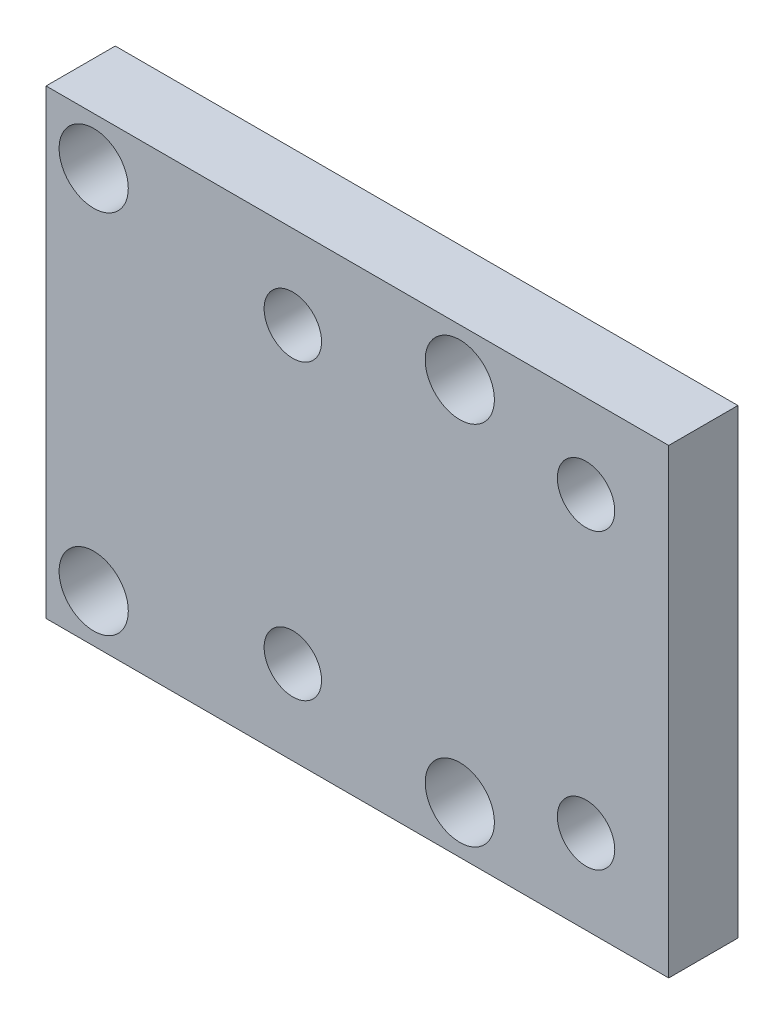
ISO-10303-21;
HEADER;
FILE_DESCRIPTION(('STEP AP214'),'2;1');
FILE_NAME('part.step','',(''),(''),'','','');
FILE_SCHEMA(('AUTOMOTIVE_DESIGN { 1 0 10303 214 1 1 1 1 }'));
ENDSEC;
DATA;
#1=APPLICATION_CONTEXT('core data for automotive mechanical design processes');
#2=APPLICATION_PROTOCOL_DEFINITION('international standard','automotive_design',2000,#1);
#3=PRODUCT_CONTEXT('',#1,'mechanical');
#4=PRODUCT('Part','Part','',(#3));
#5=PRODUCT_RELATED_PRODUCT_CATEGORY('part','',(#4));
#6=PRODUCT_DEFINITION_FORMATION('','',#4);
#7=PRODUCT_DEFINITION_CONTEXT('part definition',#1,'design');
#8=PRODUCT_DEFINITION('design','',#6,#7);
#9=PRODUCT_DEFINITION_SHAPE('','',#8);
#10=(LENGTH_UNIT() NAMED_UNIT(*) SI_UNIT(.MILLI.,.METRE.));
#11=(NAMED_UNIT(*) PLANE_ANGLE_UNIT() SI_UNIT($,.RADIAN.));
#12=(NAMED_UNIT(*) SI_UNIT($,.STERADIAN.) SOLID_ANGLE_UNIT());
#13=UNCERTAINTY_MEASURE_WITH_UNIT(LENGTH_MEASURE(1.E-05),#10,'distance_accuracy_value','');
#14=(GEOMETRIC_REPRESENTATION_CONTEXT(3) GLOBAL_UNCERTAINTY_ASSIGNED_CONTEXT((#13)) GLOBAL_UNIT_ASSIGNED_CONTEXT((#10,
#11,#12)) REPRESENTATION_CONTEXT('',''));
#15=CARTESIAN_POINT('',(0.,0.,0.));
#16=DIRECTION('',(0.,0.,1.));
#17=DIRECTION('',(1.,0.,0.));
#18=AXIS2_PLACEMENT_3D('',#15,#16,#17);
#19=CARTESIAN_POINT('',(-61.3,-35.875,6.));
#20=DIRECTION('',(0.,0.,-1.));
#21=DIRECTION('',(-1.,0.,0.));
#22=AXIS2_PLACEMENT_3D('',#19,#20,#21);
#23=CYLINDRICAL_SURFACE('',#22,2.);
#24=CARTESIAN_POINT('',(-61.3,-35.875,0.));
#25=DIRECTION('',(0.,0.,1.));
#26=DIRECTION('',(1.,0.,0.));
#27=AXIS2_PLACEMENT_3D('',#24,#25,#26);
#28=CIRCLE('',#27,2.);
#29=CARTESIAN_POINT('',(-59.3,-35.875,0.));
#30=VERTEX_POINT('',#29);
#31=EDGE_CURVE('E105',#30,#30,#28,.T.);
#32=ORIENTED_EDGE('',*,*,#31,.F.);
#33=EDGE_LOOP('',(#32));
#34=FACE_BOUND('',#33,.T.);
#35=CARTESIAN_POINT('',(-61.3,-35.875,1.));
#36=DIRECTION('',(0.,0.,1.));
#37=DIRECTION('',(1.,0.,0.));
#38=AXIS2_PLACEMENT_3D('',#35,#36,#37);
#39=CIRCLE('',#38,2.);
#40=CARTESIAN_POINT('',(-59.3,-35.875,1.));
#41=VERTEX_POINT('',#40);
#42=EDGE_CURVE('E39',#41,#41,#39,.T.);
#43=ORIENTED_EDGE('',*,*,#42,.T.);
#44=EDGE_LOOP('',(#43));
#45=FACE_BOUND('',#44,.T.);
#46=ADVANCED_FACE('F35',(#34,#45),#23,.F.);
#47=CARTESIAN_POINT('',(-29.55,-35.875,6.));
#48=DIRECTION('',(0.,0.,-1.));
#49=DIRECTION('',(-1.,0.,0.));
#50=AXIS2_PLACEMENT_3D('',#47,#48,#49);
#51=CYLINDRICAL_SURFACE('',#50,2.);
#52=CARTESIAN_POINT('',(-29.55,-35.875,0.));
#53=DIRECTION('',(0.,0.,1.));
#54=DIRECTION('',(1.,0.,0.));
#55=AXIS2_PLACEMENT_3D('',#52,#53,#54);
#56=CIRCLE('',#55,2.);
#57=CARTESIAN_POINT('',(-27.55,-35.875,0.));
#58=VERTEX_POINT('',#57);
#59=EDGE_CURVE('E150',#58,#58,#56,.T.);
#60=ORIENTED_EDGE('',*,*,#59,.F.);
#61=EDGE_LOOP('',(#60));
#62=FACE_BOUND('',#61,.T.);
#63=CARTESIAN_POINT('',(-29.55,-35.875,1.));
#64=DIRECTION('',(0.,0.,1.));
#65=DIRECTION('',(1.,0.,0.));
#66=AXIS2_PLACEMENT_3D('',#63,#64,#65);
#67=CIRCLE('',#66,2.);
#68=CARTESIAN_POINT('',(-27.55,-35.875,1.));
#69=VERTEX_POINT('',#68);
#70=EDGE_CURVE('E120',#69,#69,#67,.T.);
#71=ORIENTED_EDGE('',*,*,#70,.T.);
#72=EDGE_LOOP('',(#71));
#73=FACE_BOUND('',#72,.T.);
#74=ADVANCED_FACE('F161',(#62,#73),#51,.F.);
#75=CARTESIAN_POINT('',(-29.5500000000001,-4.12500000000002,6.));
#76=DIRECTION('',(0.,0.,-1.));
#77=DIRECTION('',(-1.,0.,0.));
#78=AXIS2_PLACEMENT_3D('',#75,#76,#77);
#79=CYLINDRICAL_SURFACE('',#78,2.);
#80=CARTESIAN_POINT('',(-29.5500000000001,-4.12500000000002,0.));
#81=DIRECTION('',(0.,0.,1.));
#82=DIRECTION('',(1.,0.,0.));
#83=AXIS2_PLACEMENT_3D('',#80,#81,#82);
#84=CIRCLE('',#83,2.);
#85=CARTESIAN_POINT('',(-27.5500000000001,-4.12500000000002,0.));
#86=VERTEX_POINT('',#85);
#87=EDGE_CURVE('E147',#86,#86,#84,.T.);
#88=ORIENTED_EDGE('',*,*,#87,.F.);
#89=EDGE_LOOP('',(#88));
#90=FACE_BOUND('',#89,.T.);
#91=CARTESIAN_POINT('',(-29.5500000000001,-4.12500000000002,1.));
#92=DIRECTION('',(0.,0.,1.));
#93=DIRECTION('',(1.,0.,0.));
#94=AXIS2_PLACEMENT_3D('',#91,#92,#93);
#95=CIRCLE('',#94,2.);
#96=CARTESIAN_POINT('',(-27.5500000000001,-4.12500000000002,1.));
#97=VERTEX_POINT('',#96);
#98=EDGE_CURVE('E116',#97,#97,#95,.T.);
#99=ORIENTED_EDGE('',*,*,#98,.T.);
#100=EDGE_LOOP('',(#99));
#101=FACE_BOUND('',#100,.T.);
#102=ADVANCED_FACE('F237',(#90,#101),#79,.F.);
#103=CARTESIAN_POINT('',(-61.3000000000001,-4.12500000000002,6.));
#104=DIRECTION('',(0.,0.,-1.));
#105=DIRECTION('',(-1.,0.,0.));
#106=AXIS2_PLACEMENT_3D('',#103,#104,#105);
#107=CYLINDRICAL_SURFACE('',#106,2.);
#108=CARTESIAN_POINT('',(-61.3000000000001,-4.12500000000002,0.));
#109=DIRECTION('',(0.,0.,1.));
#110=DIRECTION('',(1.,0.,0.));
#111=AXIS2_PLACEMENT_3D('',#108,#109,#110);
#112=CIRCLE('',#111,2.);
#113=CARTESIAN_POINT('',(-59.3000000000001,-4.12500000000002,0.));
#114=VERTEX_POINT('',#113);
#115=EDGE_CURVE('E114',#114,#114,#112,.T.);
#116=ORIENTED_EDGE('',*,*,#115,.F.);
#117=EDGE_LOOP('',(#116));
#118=FACE_BOUND('',#117,.T.);
#119=CARTESIAN_POINT('',(-61.3000000000001,-4.12500000000002,1.));
#120=DIRECTION('',(0.,0.,1.));
#121=DIRECTION('',(1.,0.,0.));
#122=AXIS2_PLACEMENT_3D('',#119,#120,#121);
#123=CIRCLE('',#122,2.);
#124=CARTESIAN_POINT('',(-59.3000000000001,-4.12500000000002,1.));
#125=VERTEX_POINT('',#124);
#126=EDGE_CURVE('E111',#125,#125,#123,.T.);
#127=ORIENTED_EDGE('',*,*,#126,.T.);
#128=EDGE_LOOP('',(#127));
#129=FACE_BOUND('',#128,.T.);
#130=ADVANCED_FACE('F202',(#118,#129),#107,.F.);
#131=CARTESIAN_POINT('',(0.,0.,6.));
#132=DIRECTION('',(0.,0.,-1.));
#133=DIRECTION('',(-1.,0.,0.));
#134=AXIS2_PLACEMENT_3D('',#131,#132,#133);
#135=PLANE('',#134);
#136=CARTESIAN_POINT('',(-18.6008068844062,-32.6999999999024,6.));
#137=DIRECTION('',(0.,0.,1.));
#138=DIRECTION('',(1.,0.,0.));
#139=AXIS2_PLACEMENT_3D('',#136,#137,#138);
#140=CIRCLE('',#139,2.49);
#141=CARTESIAN_POINT('',(-16.1108068844062,-32.6999999999024,6.));
#142=VERTEX_POINT('',#141);
#143=EDGE_CURVE('E193',#142,#142,#140,.T.);
#144=ORIENTED_EDGE('',*,*,#143,.F.);
#145=EDGE_LOOP('',(#144));
#146=FACE_BOUND('',#145,.T.);
#147=CARTESIAN_POINT('',(-44.0308068844062,-32.6999999999025,6.));
#148=DIRECTION('',(0.,0.,1.));
#149=DIRECTION('',(1.,0.,0.));
#150=AXIS2_PLACEMENT_3D('',#147,#148,#149);
#151=CIRCLE('',#150,2.49);
#152=CARTESIAN_POINT('',(-41.5408068844062,-32.6999999999025,6.));
#153=VERTEX_POINT('',#152);
#154=EDGE_CURVE('E187',#153,#153,#151,.T.);
#155=ORIENTED_EDGE('',*,*,#154,.F.);
#156=EDGE_LOOP('',(#155));
#157=FACE_BOUND('',#156,.T.);
#158=CARTESIAN_POINT('',(-44.0308068844065,-7.26999999990253,6.));
#159=DIRECTION('',(0.,0.,1.));
#160=DIRECTION('',(1.,0.,0.));
#161=AXIS2_PLACEMENT_3D('',#158,#159,#160);
#162=CIRCLE('',#161,2.49);
#163=CARTESIAN_POINT('',(-41.5408068844065,-7.26999999990253,6.));
#164=VERTEX_POINT('',#163);
#165=EDGE_CURVE('E181',#164,#164,#162,.T.);
#166=ORIENTED_EDGE('',*,*,#165,.F.);
#167=EDGE_LOOP('',(#166));
#168=FACE_BOUND('',#167,.T.);
#169=CARTESIAN_POINT('',(-18.6008068844065,-7.26999999990236,6.));
#170=DIRECTION('',(0.,0.,1.));
#171=DIRECTION('',(1.,0.,0.));
#172=AXIS2_PLACEMENT_3D('',#169,#170,#171);
#173=CIRCLE('',#172,2.49);
#174=CARTESIAN_POINT('',(-16.1108068844065,-7.26999999990236,6.));
#175=VERTEX_POINT('',#174);
#176=EDGE_CURVE('E175',#175,#175,#173,.T.);
#177=ORIENTED_EDGE('',*,*,#176,.F.);
#178=EDGE_LOOP('',(#177));
#179=FACE_BOUND('',#178,.T.);
#180=CARTESIAN_POINT('',(-61.2999999999998,-35.875,6.));
#181=DIRECTION('',(0.,0.,1.));
#182=DIRECTION('',(1.,0.,0.));
#183=AXIS2_PLACEMENT_3D('',#180,#181,#182);
#184=CIRCLE('',#183,3.);
#185=CARTESIAN_POINT('',(-58.2999999999998,-35.875,6.));
#186=VERTEX_POINT('',#185);
#187=EDGE_CURVE('E136',#186,#186,#184,.T.);
#188=ORIENTED_EDGE('',*,*,#187,.F.);
#189=EDGE_LOOP('',(#188));
#190=FACE_BOUND('',#189,.T.);
#191=CARTESIAN_POINT('',(-29.5499999999998,-35.875,6.));
#192=DIRECTION('',(0.,0.,1.));
#193=DIRECTION('',(1.,0.,0.));
#194=AXIS2_PLACEMENT_3D('',#191,#192,#193);
#195=CIRCLE('',#194,3.);
#196=CARTESIAN_POINT('',(-26.5499999999998,-35.875,6.));
#197=VERTEX_POINT('',#196);
#198=EDGE_CURVE('E129',#197,#197,#195,.T.);
#199=ORIENTED_EDGE('',*,*,#198,.F.);
#200=EDGE_LOOP('',(#199));
#201=FACE_BOUND('',#200,.T.);
#202=CARTESIAN_POINT('',(-29.5500000000001,-4.12500000000002,6.));
#203=DIRECTION('',(0.,0.,1.));
#204=DIRECTION('',(1.,0.,0.));
#205=AXIS2_PLACEMENT_3D('',#202,#203,#204);
#206=CIRCLE('',#205,3.);
#207=CARTESIAN_POINT('',(-26.5500000000001,-4.12500000000002,6.));
#208=VERTEX_POINT('',#207);
#209=EDGE_CURVE('E122',#208,#208,#206,.T.);
#210=ORIENTED_EDGE('',*,*,#209,.F.);
#211=EDGE_LOOP('',(#210));
#212=FACE_BOUND('',#211,.T.);
#213=CARTESIAN_POINT('',(-61.3000000000001,-4.12500000000002,6.));
#214=DIRECTION('',(0.,0.,1.));
#215=DIRECTION('',(1.,0.,0.));
#216=AXIS2_PLACEMENT_3D('',#213,#214,#215);
#217=CIRCLE('',#216,3.);
#218=CARTESIAN_POINT('',(-58.3000000000001,-4.12500000000002,6.));
#219=VERTEX_POINT('',#218);
#220=EDGE_CURVE('E118',#219,#219,#217,.T.);
#221=ORIENTED_EDGE('',*,*,#220,.F.);
#222=EDGE_LOOP('',(#221));
#223=FACE_BOUND('',#222,.T.);
#224=DIRECTION('',(0.,1.,0.));
#225=VECTOR('',#224,1.);
#226=CARTESIAN_POINT('',(-11.43,0.,6.));
#227=LINE('',#226,#225);
#228=CARTESIAN_POINT('',(-11.43,-40.,6.));
#229=VERTEX_POINT('',#228);
#230=CARTESIAN_POINT('',(-11.43,0.,6.));
#231=VERTEX_POINT('',#230);
#232=EDGE_CURVE('E89',#229,#231,#227,.T.);
#233=ORIENTED_EDGE('',*,*,#232,.T.);
#234=DIRECTION('',(-1.,0.,0.));
#235=VECTOR('',#234,1.);
#236=CARTESIAN_POINT('',(-11.43,0.,6.));
#237=LINE('',#236,#235);
#238=CARTESIAN_POINT('',(-65.43,0.,6.));
#239=VERTEX_POINT('',#238);
#240=EDGE_CURVE('E84',#231,#239,#237,.T.);
#241=ORIENTED_EDGE('',*,*,#240,.T.);
#242=DIRECTION('',(0.,-1.,0.));
#243=VECTOR('',#242,1.);
#244=CARTESIAN_POINT('',(-65.43,0.,6.));
#245=LINE('',#244,#243);
#246=CARTESIAN_POINT('',(-65.43,-40.,6.));
#247=VERTEX_POINT('',#246);
#248=EDGE_CURVE('E87',#239,#247,#245,.T.);
#249=ORIENTED_EDGE('',*,*,#248,.T.);
#250=DIRECTION('',(1.,0.,0.));
#251=VECTOR('',#250,1.);
#252=CARTESIAN_POINT('',(-11.43,-40.,6.));
#253=LINE('',#252,#251);
#254=EDGE_CURVE('E54',#247,#229,#253,.T.);
#255=ORIENTED_EDGE('',*,*,#254,.T.);
#256=EDGE_LOOP('',(#233,#241,#249,#255));
#257=FACE_BOUND('',#256,.T.);
#258=ADVANCED_FACE('F85',(#146,#157,#168,#179,#190,#201,#212,#223,#257),#135,.F.);
#259=CARTESIAN_POINT('',(0.,0.,0.));
#260=DIRECTION('',(0.,0.,-1.));
#261=DIRECTION('',(-1.,0.,0.));
#262=AXIS2_PLACEMENT_3D('',#259,#260,#261);
#263=PLANE('',#262);
#264=CARTESIAN_POINT('',(-18.6008068844062,-32.6999999999024,0.));
#265=DIRECTION('',(0.,0.,-1.));
#266=DIRECTION('',(-1.,0.,0.));
#267=AXIS2_PLACEMENT_3D('',#264,#265,#266);
#268=CIRCLE('',#267,2.49);
#269=CARTESIAN_POINT('',(-21.0908068844062,-32.6999999999024,0.));
#270=VERTEX_POINT('',#269);
#271=EDGE_CURVE('E190',#270,#270,#268,.F.);
#272=ORIENTED_EDGE('',*,*,#271,.T.);
#273=EDGE_LOOP('',(#272));
#274=FACE_BOUND('',#273,.T.);
#275=CARTESIAN_POINT('',(-44.0308068844062,-32.6999999999025,0.));
#276=DIRECTION('',(0.,0.,-1.));
#277=DIRECTION('',(-1.,0.,0.));
#278=AXIS2_PLACEMENT_3D('',#275,#276,#277);
#279=CIRCLE('',#278,2.49);
#280=CARTESIAN_POINT('',(-46.5208068844062,-32.6999999999025,0.));
#281=VERTEX_POINT('',#280);
#282=EDGE_CURVE('E184',#281,#281,#279,.F.);
#283=ORIENTED_EDGE('',*,*,#282,.T.);
#284=EDGE_LOOP('',(#283));
#285=FACE_BOUND('',#284,.T.);
#286=CARTESIAN_POINT('',(-44.0308068844065,-7.26999999990253,0.));
#287=DIRECTION('',(0.,0.,-1.));
#288=DIRECTION('',(-1.,0.,0.));
#289=AXIS2_PLACEMENT_3D('',#286,#287,#288);
#290=CIRCLE('',#289,2.49);
#291=CARTESIAN_POINT('',(-46.5208068844065,-7.26999999990253,0.));
#292=VERTEX_POINT('',#291);
#293=EDGE_CURVE('E178',#292,#292,#290,.F.);
#294=ORIENTED_EDGE('',*,*,#293,.T.);
#295=EDGE_LOOP('',(#294));
#296=FACE_BOUND('',#295,.T.);
#297=CARTESIAN_POINT('',(-18.6008068844065,-7.26999999990236,0.));
#298=DIRECTION('',(0.,0.,-1.));
#299=DIRECTION('',(-1.,0.,0.));
#300=AXIS2_PLACEMENT_3D('',#297,#298,#299);
#301=CIRCLE('',#300,2.49);
#302=CARTESIAN_POINT('',(-21.0908068844065,-7.26999999990236,0.));
#303=VERTEX_POINT('',#302);
#304=EDGE_CURVE('E171',#303,#303,#301,.F.);
#305=ORIENTED_EDGE('',*,*,#304,.T.);
#306=EDGE_LOOP('',(#305));
#307=FACE_BOUND('',#306,.T.);
#308=ORIENTED_EDGE('',*,*,#87,.T.);
#309=EDGE_LOOP('',(#308));
#310=FACE_BOUND('',#309,.T.);
#311=ORIENTED_EDGE('',*,*,#31,.T.);
#312=EDGE_LOOP('',(#311));
#313=FACE_BOUND('',#312,.T.);
#314=DIRECTION('',(0.,1.,0.));
#315=VECTOR('',#314,1.);
#316=CARTESIAN_POINT('',(-11.43,0.,0.));
#317=LINE('',#316,#315);
#318=CARTESIAN_POINT('',(-11.43,-40.,0.));
#319=VERTEX_POINT('',#318);
#320=CARTESIAN_POINT('',(-11.43,0.,0.));
#321=VERTEX_POINT('',#320);
#322=EDGE_CURVE('E102',#319,#321,#317,.T.);
#323=ORIENTED_EDGE('',*,*,#322,.F.);
#324=DIRECTION('',(1.,0.,0.));
#325=VECTOR('',#324,1.);
#326=CARTESIAN_POINT('',(-11.43,-40.,0.));
#327=LINE('',#326,#325);
#328=CARTESIAN_POINT('',(-65.43,-40.,0.));
#329=VERTEX_POINT('',#328);
#330=EDGE_CURVE('E77',#329,#319,#327,.T.);
#331=ORIENTED_EDGE('',*,*,#330,.F.);
#332=DIRECTION('',(0.,-1.,0.));
#333=VECTOR('',#332,1.);
#334=CARTESIAN_POINT('',(-65.43,0.,0.));
#335=LINE('',#334,#333);
#336=CARTESIAN_POINT('',(-65.43,0.,0.));
#337=VERTEX_POINT('',#336);
#338=EDGE_CURVE('E71',#337,#329,#335,.T.);
#339=ORIENTED_EDGE('',*,*,#338,.F.);
#340=DIRECTION('',(-1.,0.,0.));
#341=VECTOR('',#340,1.);
#342=CARTESIAN_POINT('',(-11.43,0.,0.));
#343=LINE('',#342,#341);
#344=EDGE_CURVE('E93',#321,#337,#343,.T.);
#345=ORIENTED_EDGE('',*,*,#344,.F.);
#346=EDGE_LOOP('',(#323,#331,#339,#345));
#347=FACE_BOUND('',#346,.T.);
#348=ORIENTED_EDGE('',*,*,#59,.T.);
#349=EDGE_LOOP('',(#348));
#350=FACE_BOUND('',#349,.T.);
#351=ORIENTED_EDGE('',*,*,#115,.T.);
#352=EDGE_LOOP('',(#351));
#353=FACE_BOUND('',#352,.T.);
#354=ADVANCED_FACE('F156',(#274,#285,#296,#307,#310,#313,#347,#350,#353),#263,.T.);
#355=CARTESIAN_POINT('',(-11.43,0.,6.));
#356=DIRECTION('',(-1.,0.,0.));
#357=DIRECTION('',(0.,-1.,0.));
#358=AXIS2_PLACEMENT_3D('',#355,#356,#357);
#359=PLANE('',#358);
#360=ORIENTED_EDGE('',*,*,#322,.T.);
#361=DIRECTION('',(0.,0.,-1.));
#362=VECTOR('',#361,1.);
#363=CARTESIAN_POINT('',(-11.43,0.,6.));
#364=LINE('',#363,#362);
#365=EDGE_CURVE('E11',#231,#321,#364,.T.);
#366=ORIENTED_EDGE('',*,*,#365,.F.);
#367=ORIENTED_EDGE('',*,*,#232,.F.);
#368=DIRECTION('',(0.,0.,-1.));
#369=VECTOR('',#368,1.);
#370=CARTESIAN_POINT('',(-11.43,-40.,6.));
#371=LINE('',#370,#369);
#372=EDGE_CURVE('E98',#229,#319,#371,.T.);
#373=ORIENTED_EDGE('',*,*,#372,.T.);
#374=EDGE_LOOP('',(#360,#366,#367,#373));
#375=FACE_BOUND('',#374,.T.);
#376=ADVANCED_FACE('F37',(#375),#359,.F.);
#377=CARTESIAN_POINT('',(-11.43,0.,6.));
#378=DIRECTION('',(0.,-1.,0.));
#379=DIRECTION('',(1.,0.,0.));
#380=AXIS2_PLACEMENT_3D('',#377,#378,#379);
#381=PLANE('',#380);
#382=ORIENTED_EDGE('',*,*,#344,.T.);
#383=DIRECTION('',(0.,0.,-1.));
#384=VECTOR('',#383,1.);
#385=CARTESIAN_POINT('',(-65.43,0.,6.));
#386=LINE('',#385,#384);
#387=EDGE_CURVE('E45',#239,#337,#386,.T.);
#388=ORIENTED_EDGE('',*,*,#387,.F.);
#389=ORIENTED_EDGE('',*,*,#240,.F.);
#390=ORIENTED_EDGE('',*,*,#365,.T.);
#391=EDGE_LOOP('',(#382,#388,#389,#390));
#392=FACE_BOUND('',#391,.T.);
#393=ADVANCED_FACE('F92',(#392),#381,.F.);
#394=CARTESIAN_POINT('',(-65.43,0.,6.));
#395=DIRECTION('',(1.,0.,0.));
#396=DIRECTION('',(0.,1.,0.));
#397=AXIS2_PLACEMENT_3D('',#394,#395,#396);
#398=PLANE('',#397);
#399=ORIENTED_EDGE('',*,*,#338,.T.);
#400=DIRECTION('',(0.,0.,-1.));
#401=VECTOR('',#400,1.);
#402=CARTESIAN_POINT('',(-65.43,-40.,6.));
#403=LINE('',#402,#401);
#404=EDGE_CURVE('E94',#247,#329,#403,.T.);
#405=ORIENTED_EDGE('',*,*,#404,.F.);
#406=ORIENTED_EDGE('',*,*,#248,.F.);
#407=ORIENTED_EDGE('',*,*,#387,.T.);
#408=EDGE_LOOP('',(#399,#405,#406,#407));
#409=FACE_BOUND('',#408,.T.);
#410=ADVANCED_FACE('F96',(#409),#398,.F.);
#411=CARTESIAN_POINT('',(-11.43,-40.,6.));
#412=DIRECTION('',(0.,1.,0.));
#413=DIRECTION('',(-1.,0.,0.));
#414=AXIS2_PLACEMENT_3D('',#411,#412,#413);
#415=PLANE('',#414);
#416=ORIENTED_EDGE('',*,*,#330,.T.);
#417=ORIENTED_EDGE('',*,*,#372,.F.);
#418=ORIENTED_EDGE('',*,*,#254,.F.);
#419=ORIENTED_EDGE('',*,*,#404,.T.);
#420=EDGE_LOOP('',(#416,#417,#418,#419));
#421=FACE_BOUND('',#420,.T.);
#422=ADVANCED_FACE('F221',(#421),#415,.F.);
#423=CARTESIAN_POINT('',(-61.3000000000001,-4.12500000000002,1.));
#424=DIRECTION('',(0.,0.,1.));
#425=DIRECTION('',(1.,0.,0.));
#426=AXIS2_PLACEMENT_3D('',#423,#424,#425);
#427=CYLINDRICAL_SURFACE('',#426,3.);
#428=CARTESIAN_POINT('',(-61.3000000000001,-4.12500000000002,1.));
#429=DIRECTION('',(0.,0.,1.));
#430=DIRECTION('',(1.,0.,0.));
#431=AXIS2_PLACEMENT_3D('',#428,#429,#430);
#432=CIRCLE('',#431,3.);
#433=CARTESIAN_POINT('',(-58.3000000000001,-4.12500000000002,1.));
#434=VERTEX_POINT('',#433);
#435=EDGE_CURVE('E115',#434,#434,#432,.T.);
#436=ORIENTED_EDGE('',*,*,#435,.F.);
#437=EDGE_LOOP('',(#436));
#438=FACE_BOUND('',#437,.T.);
#439=ORIENTED_EDGE('',*,*,#220,.T.);
#440=EDGE_LOOP('',(#439));
#441=FACE_BOUND('',#440,.T.);
#442=ADVANCED_FACE('F218',(#438,#441),#427,.F.);
#443=CARTESIAN_POINT('',(-61.3000000000001,-4.12500000000002,1.));
#444=DIRECTION('',(0.,0.,1.));
#445=DIRECTION('',(1.,0.,0.));
#446=AXIS2_PLACEMENT_3D('',#443,#444,#445);
#447=PLANE('',#446);
#448=ORIENTED_EDGE('',*,*,#126,.F.);
#449=EDGE_LOOP('',(#448));
#450=FACE_BOUND('',#449,.T.);
#451=ORIENTED_EDGE('',*,*,#435,.T.);
#452=EDGE_LOOP('',(#451));
#453=FACE_BOUND('',#452,.T.);
#454=ADVANCED_FACE('F220',(#450,#453),#447,.T.);
#455=CARTESIAN_POINT('',(-29.5500000000001,-4.12500000000002,1.));
#456=DIRECTION('',(0.,0.,1.));
#457=DIRECTION('',(1.,0.,0.));
#458=AXIS2_PLACEMENT_3D('',#455,#456,#457);
#459=CYLINDRICAL_SURFACE('',#458,3.);
#460=CARTESIAN_POINT('',(-29.5500000000001,-4.12500000000002,1.));
#461=DIRECTION('',(0.,0.,1.));
#462=DIRECTION('',(1.,0.,0.));
#463=AXIS2_PLACEMENT_3D('',#460,#461,#462);
#464=CIRCLE('',#463,3.);
#465=CARTESIAN_POINT('',(-26.5500000000001,-4.12500000000002,1.));
#466=VERTEX_POINT('',#465);
#467=EDGE_CURVE('E119',#466,#466,#464,.T.);
#468=ORIENTED_EDGE('',*,*,#467,.F.);
#469=EDGE_LOOP('',(#468));
#470=FACE_BOUND('',#469,.T.);
#471=ORIENTED_EDGE('',*,*,#209,.T.);
#472=EDGE_LOOP('',(#471));
#473=FACE_BOUND('',#472,.T.);
#474=ADVANCED_FACE('F228',(#470,#473),#459,.F.);
#475=CARTESIAN_POINT('',(-29.5500000000001,-4.12500000000002,1.));
#476=DIRECTION('',(0.,0.,1.));
#477=DIRECTION('',(1.,0.,0.));
#478=AXIS2_PLACEMENT_3D('',#475,#476,#477);
#479=PLANE('',#478);
#480=ORIENTED_EDGE('',*,*,#98,.F.);
#481=EDGE_LOOP('',(#480));
#482=FACE_BOUND('',#481,.T.);
#483=ORIENTED_EDGE('',*,*,#467,.T.);
#484=EDGE_LOOP('',(#483));
#485=FACE_BOUND('',#484,.T.);
#486=ADVANCED_FACE('F362',(#482,#485),#479,.T.);
#487=CARTESIAN_POINT('',(-29.5499999999998,-35.875,1.));
#488=DIRECTION('',(0.,0.,1.));
#489=DIRECTION('',(1.,0.,0.));
#490=AXIS2_PLACEMENT_3D('',#487,#488,#489);
#491=CYLINDRICAL_SURFACE('',#490,3.);
#492=CARTESIAN_POINT('',(-29.5499999999998,-35.875,1.));
#493=DIRECTION('',(0.,0.,1.));
#494=DIRECTION('',(1.,0.,0.));
#495=AXIS2_PLACEMENT_3D('',#492,#493,#494);
#496=CIRCLE('',#495,3.);
#497=CARTESIAN_POINT('',(-26.5499999999998,-35.875,1.));
#498=VERTEX_POINT('',#497);
#499=EDGE_CURVE('E123',#498,#498,#496,.T.);
#500=ORIENTED_EDGE('',*,*,#499,.F.);
#501=EDGE_LOOP('',(#500));
#502=FACE_BOUND('',#501,.T.);
#503=ORIENTED_EDGE('',*,*,#198,.T.);
#504=EDGE_LOOP('',(#503));
#505=FACE_BOUND('',#504,.T.);
#506=ADVANCED_FACE('F352',(#502,#505),#491,.F.);
#507=CARTESIAN_POINT('',(-29.5499999999998,-35.875,1.));
#508=DIRECTION('',(0.,0.,1.));
#509=DIRECTION('',(1.,0.,0.));
#510=AXIS2_PLACEMENT_3D('',#507,#508,#509);
#511=PLANE('',#510);
#512=ORIENTED_EDGE('',*,*,#70,.F.);
#513=EDGE_LOOP('',(#512));
#514=FACE_BOUND('',#513,.T.);
#515=ORIENTED_EDGE('',*,*,#499,.T.);
#516=EDGE_LOOP('',(#515));
#517=FACE_BOUND('',#516,.T.);
#518=ADVANCED_FACE('F342',(#514,#517),#511,.T.);
#519=CARTESIAN_POINT('',(-61.2999999999998,-35.875,1.));
#520=DIRECTION('',(0.,0.,1.));
#521=DIRECTION('',(1.,0.,0.));
#522=AXIS2_PLACEMENT_3D('',#519,#520,#521);
#523=CYLINDRICAL_SURFACE('',#522,3.);
#524=CARTESIAN_POINT('',(-61.2999999999998,-35.875,1.));
#525=DIRECTION('',(0.,0.,1.));
#526=DIRECTION('',(1.,0.,0.));
#527=AXIS2_PLACEMENT_3D('',#524,#525,#526);
#528=CIRCLE('',#527,3.);
#529=CARTESIAN_POINT('',(-58.2999999999998,-35.875,1.));
#530=VERTEX_POINT('',#529);
#531=EDGE_CURVE('E166',#530,#530,#528,.T.);
#532=ORIENTED_EDGE('',*,*,#531,.F.);
#533=EDGE_LOOP('',(#532));
#534=FACE_BOUND('',#533,.T.);
#535=ORIENTED_EDGE('',*,*,#187,.T.);
#536=EDGE_LOOP('',(#535));
#537=FACE_BOUND('',#536,.T.);
#538=ADVANCED_FACE('F331',(#534,#537),#523,.F.);
#539=CARTESIAN_POINT('',(-61.2999999999998,-35.875,1.));
#540=DIRECTION('',(0.,0.,1.));
#541=DIRECTION('',(1.,0.,0.));
#542=AXIS2_PLACEMENT_3D('',#539,#540,#541);
#543=PLANE('',#542);
#544=ORIENTED_EDGE('',*,*,#42,.F.);
#545=EDGE_LOOP('',(#544));
#546=FACE_BOUND('',#545,.T.);
#547=ORIENTED_EDGE('',*,*,#531,.T.);
#548=EDGE_LOOP('',(#547));
#549=FACE_BOUND('',#548,.T.);
#550=ADVANCED_FACE('F325',(#546,#549),#543,.T.);
#551=CARTESIAN_POINT('',(-18.6008068844065,-7.26999999990236,-7.04278354061801));
#552=DIRECTION('',(0.,0.,1.));
#553=DIRECTION('',(1.,0.,0.));
#554=AXIS2_PLACEMENT_3D('',#551,#552,#553);
#555=CYLINDRICAL_SURFACE('',#554,2.49);
#556=ORIENTED_EDGE('',*,*,#176,.T.);
#557=EDGE_LOOP('',(#556));
#558=FACE_BOUND('',#557,.T.);
#559=ORIENTED_EDGE('',*,*,#304,.F.);
#560=EDGE_LOOP('',(#559));
#561=FACE_BOUND('',#560,.T.);
#562=ADVANCED_FACE('F330',(#558,#561),#555,.F.);
#563=CARTESIAN_POINT('',(-44.0308068844065,-7.26999999990253,-7.04278354061801));
#564=DIRECTION('',(0.,0.,1.));
#565=DIRECTION('',(1.,0.,0.));
#566=AXIS2_PLACEMENT_3D('',#563,#564,#565);
#567=CYLINDRICAL_SURFACE('',#566,2.49);
#568=ORIENTED_EDGE('',*,*,#165,.T.);
#569=EDGE_LOOP('',(#568));
#570=FACE_BOUND('',#569,.T.);
#571=ORIENTED_EDGE('',*,*,#293,.F.);
#572=EDGE_LOOP('',(#571));
#573=FACE_BOUND('',#572,.T.);
#574=ADVANCED_FACE('F397',(#570,#573),#567,.F.);
#575=CARTESIAN_POINT('',(-44.0308068844062,-32.6999999999025,-7.04278354061801));
#576=DIRECTION('',(0.,0.,1.));
#577=DIRECTION('',(1.,0.,0.));
#578=AXIS2_PLACEMENT_3D('',#575,#576,#577);
#579=CYLINDRICAL_SURFACE('',#578,2.49);
#580=ORIENTED_EDGE('',*,*,#154,.T.);
#581=EDGE_LOOP('',(#580));
#582=FACE_BOUND('',#581,.T.);
#583=ORIENTED_EDGE('',*,*,#282,.F.);
#584=EDGE_LOOP('',(#583));
#585=FACE_BOUND('',#584,.T.);
#586=ADVANCED_FACE('F401',(#582,#585),#579,.F.);
#587=CARTESIAN_POINT('',(-18.6008068844062,-32.6999999999024,-7.04278354061801));
#588=DIRECTION('',(0.,0.,1.));
#589=DIRECTION('',(1.,0.,0.));
#590=AXIS2_PLACEMENT_3D('',#587,#588,#589);
#591=CYLINDRICAL_SURFACE('',#590,2.49);
#592=ORIENTED_EDGE('',*,*,#143,.T.);
#593=EDGE_LOOP('',(#592));
#594=FACE_BOUND('',#593,.T.);
#595=ORIENTED_EDGE('',*,*,#271,.F.);
#596=EDGE_LOOP('',(#595));
#597=FACE_BOUND('',#596,.T.);
#598=ADVANCED_FACE('F197',(#594,#597),#591,.F.);
#599=CLOSED_SHELL('',(#46,#74,#102,#130,#258,#354,#376,#393,#410,#422,#442,#454,#474,#486,#506,
#518,#538,#550,#562,#574,#586,#598));
#600=MANIFOLD_SOLID_BREP('B2',#599);
#601=ADVANCED_BREP_SHAPE_REPRESENTATION('',(#18,#600),#14);
#602=SHAPE_DEFINITION_REPRESENTATION(#9,#601);
ENDSEC;
END-ISO-10303-21;
